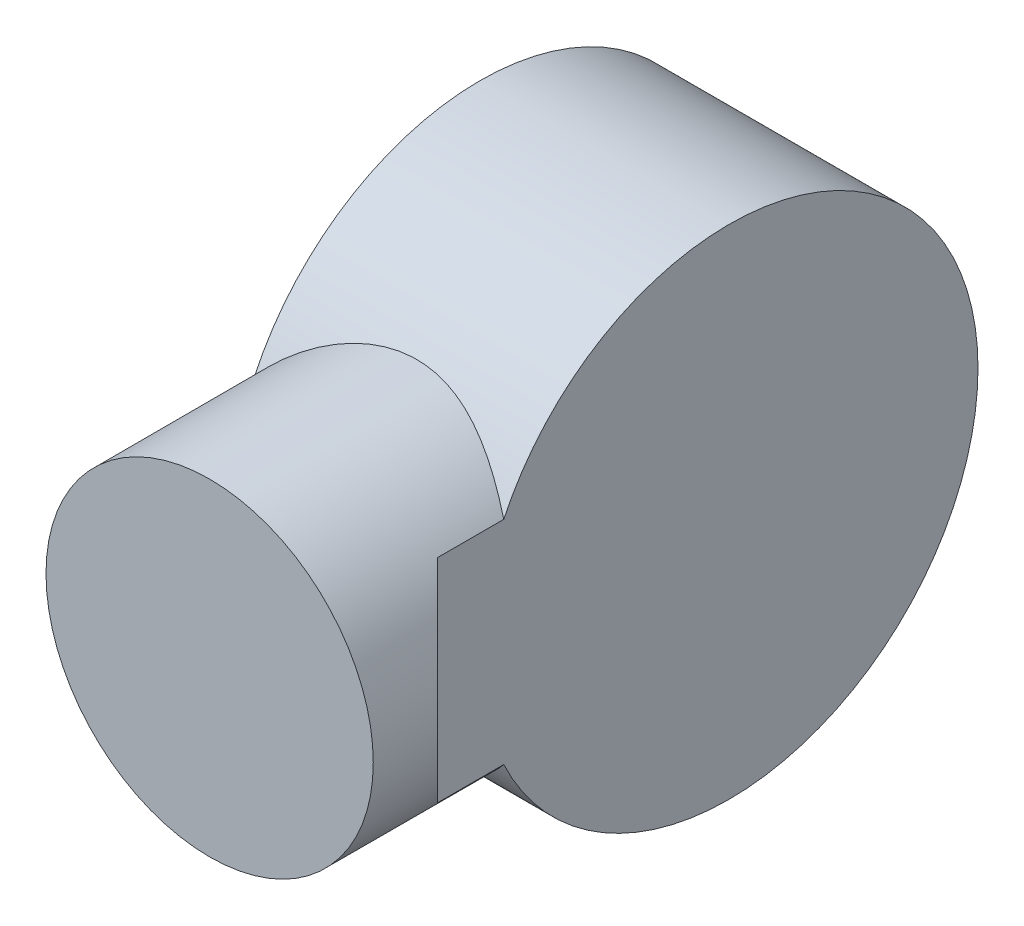
ISO-10303-21;
HEADER;
FILE_DESCRIPTION(('STEP AP214'),'2;1');
FILE_NAME('part.step','',(''),(''),'','','');
FILE_SCHEMA(('AUTOMOTIVE_DESIGN { 1 0 10303 214 1 1 1 1 }'));
ENDSEC;
DATA;
#1=APPLICATION_CONTEXT('core data for automotive mechanical design processes');
#2=APPLICATION_PROTOCOL_DEFINITION('international standard','automotive_design',2000,#1);
#3=PRODUCT_CONTEXT('',#1,'mechanical');
#4=PRODUCT('Part','Part','',(#3));
#5=PRODUCT_RELATED_PRODUCT_CATEGORY('part','',(#4));
#6=PRODUCT_DEFINITION_FORMATION('','',#4);
#7=PRODUCT_DEFINITION_CONTEXT('part definition',#1,'design');
#8=PRODUCT_DEFINITION('design','',#6,#7);
#9=PRODUCT_DEFINITION_SHAPE('','',#8);
#10=(LENGTH_UNIT() NAMED_UNIT(*) SI_UNIT(.MILLI.,.METRE.));
#11=(NAMED_UNIT(*) PLANE_ANGLE_UNIT() SI_UNIT($,.RADIAN.));
#12=(NAMED_UNIT(*) SI_UNIT($,.STERADIAN.) SOLID_ANGLE_UNIT());
#13=UNCERTAINTY_MEASURE_WITH_UNIT(LENGTH_MEASURE(1.E-05),#10,'distance_accuracy_value','');
#14=(GEOMETRIC_REPRESENTATION_CONTEXT(3) GLOBAL_UNCERTAINTY_ASSIGNED_CONTEXT((#13)) GLOBAL_UNIT_ASSIGNED_CONTEXT((#10,
#11,#12)) REPRESENTATION_CONTEXT('',''));
#15=CARTESIAN_POINT('',(0.,0.,0.));
#16=DIRECTION('',(0.,0.,1.));
#17=DIRECTION('',(1.,0.,0.));
#18=AXIS2_PLACEMENT_3D('',#15,#16,#17);
#19=CARTESIAN_POINT('',(49.,0.,905.998));
#20=DIRECTION('',(0.,0.,1.));
#21=DIRECTION('',(1.,0.,0.));
#22=AXIS2_PLACEMENT_3D('',#19,#20,#21);
#23=CYLINDRICAL_SURFACE('',#22,23.);
#24=CARTESIAN_POINT('',(49.,0.,964.5));
#25=DIRECTION('',(0.707106781186547,0.,0.707106781186548));
#26=DIRECTION('',(-0.707106781186548,0.,0.707106781186547));
#27=AXIS2_PLACEMENT_3D('',#24,#25,#26);
#28=ELLIPSE('',#27,32.5269119345812,23.);
#29=CARTESIAN_POINT('',(31.5,14.9248115565992,982.));
#30=VERTEX_POINT('',#29);
#31=CARTESIAN_POINT('',(31.5,-14.9248115565992,982.));
#32=VERTEX_POINT('',#31);
#33=EDGE_CURVE('E38',#30,#32,#28,.T.);
#34=ORIENTED_EDGE('',*,*,#33,.T.);
#35=DIRECTION('',(0.,0.,1.));
#36=VECTOR('',#35,1.);
#37=CARTESIAN_POINT('',(31.5,-14.9248115565992,905.998));
#38=LINE('',#37,#36);
#39=CARTESIAN_POINT('',(31.5,-14.9248115565992,972.658332236554));
#40=VERTEX_POINT('',#39);
#41=EDGE_CURVE('E138',#32,#40,#38,.F.);
#42=ORIENTED_EDGE('',*,*,#41,.T.);
#43=CARTESIAN_POINT('',(72.,0.,976.));
#44=CARTESIAN_POINT('',(71.9999974899214,-0.579392156234224,975.999997689453));
#45=CARTESIAN_POINT('',(71.9780758509982,-1.15882159599257,975.985580836534));
#46=CARTESIAN_POINT('',(71.8907214042049,-2.31298461608352,975.928270163406));
#47=CARTESIAN_POINT('',(71.8252850482549,-2.88771780962747,975.88537402107));
#48=CARTESIAN_POINT('',(71.6518385668175,-4.02829461207584,975.772136502232));
#49=CARTESIAN_POINT('',(71.5438042639617,-4.59413298255094,975.701779539991));
#50=CARTESIAN_POINT('',(71.2866930460353,-5.7124916316559,975.535302208606));
#51=CARTESIAN_POINT('',(71.1376164013162,-6.26501199798722,975.439182009168));
#52=CARTESIAN_POINT('',(70.8011512275983,-7.35059325130979,975.223874289497));
#53=CARTESIAN_POINT('',(70.6139495312577,-7.88373463586814,975.104799405735));
#54=CARTESIAN_POINT('',(70.2029182388201,-8.93042113717088,974.845801516114));
#55=CARTESIAN_POINT('',(69.9790886764442,-9.44396627195581,974.705878529449));
#56=CARTESIAN_POINT('',(69.4970012648832,-10.4490969206646,974.407950424157));
#57=CARTESIAN_POINT('',(69.2387452807688,-10.940683622274,974.249946285152));
#58=CARTESIAN_POINT('',(68.6899012134841,-11.9001392427702,973.918753345899));
#59=CARTESIAN_POINT('',(68.3993093818501,-12.3680054027343,973.745562785692));
#60=CARTESIAN_POINT('',(67.7621852793689,-13.3166677261423,973.372017325216));
#61=CARTESIAN_POINT('',(67.4130066215358,-13.7952686877747,973.170602081175));
#62=CARTESIAN_POINT('',(66.6812625426876,-14.7214585702166,972.757453313136));
#63=CARTESIAN_POINT('',(66.2986956184672,-15.169046093111,972.545719324758));
#64=CARTESIAN_POINT('',(65.5015595237633,-16.0326005449991,972.115730127228));
#65=CARTESIAN_POINT('',(65.0869490109654,-16.4485252026192,971.897466724027));
#66=CARTESIAN_POINT('',(64.2277403713228,-17.2470268613519,971.45894916796));
#67=CARTESIAN_POINT('',(63.7831404762812,-17.6296018930914,971.238694898374));
#68=CARTESIAN_POINT('',(62.795110707468,-18.4160856782575,970.767243230525));
#69=CARTESIAN_POINT('',(62.2469569160229,-18.8143300427071,970.516457095089));
#70=CARTESIAN_POINT('',(61.1140914503697,-19.562970875658,970.025688187753));
#71=CARTESIAN_POINT('',(60.5293718551497,-19.9133569242154,969.785707776128));
#72=CARTESIAN_POINT('',(59.3260001021839,-20.5630895288667,969.325213095387));
#73=CARTESIAN_POINT('',(58.7073957171631,-20.862505615856,969.104672508765));
#74=CARTESIAN_POINT('',(57.4379302394086,-21.4074263256684,968.6918583293));
#75=CARTESIAN_POINT('',(56.787084339533,-21.6529560501513,968.499571588939));
#76=CARTESIAN_POINT('',(55.644460055622,-22.0250635382025,968.201769486451));
#77=CARTESIAN_POINT('',(55.1596010977196,-22.1656585017504,968.08707794546));
#78=CARTESIAN_POINT('',(54.177067795029,-22.4155027489373,967.880690782996));
#79=CARTESIAN_POINT('',(53.6793955521229,-22.524757138408,967.788991416072));
#80=CARTESIAN_POINT('',(52.6745616083868,-22.710311120186,967.631871545078));
#81=CARTESIAN_POINT('',(52.1674143778585,-22.7866572633476,967.566413929578));
#82=CARTESIAN_POINT('',(51.146256738687,-22.9054087795153,967.464097107342));
#83=CARTESIAN_POINT('',(50.6322462778981,-22.9478138944942,967.42723811802));
#84=CARTESIAN_POINT('',(49.5993093995588,-22.9980255564483,967.383554693297));
#85=CARTESIAN_POINT('',(49.0803717740597,-23.005701716925,967.376843445343));
#86=CARTESIAN_POINT('',(48.0436796926312,-22.9859574634862,967.394050861961));
#87=CARTESIAN_POINT('',(47.5259252416544,-22.9585369029329,967.417969654509));
#88=CARTESIAN_POINT('',(46.495303235706,-22.8690680679741,967.495456076365));
#89=CARTESIAN_POINT('',(45.982439562892,-22.8069942922013,967.549045540136));
#90=CARTESIAN_POINT('',(44.9656109294026,-22.64924849296,967.683745030327));
#91=CARTESIAN_POINT('',(44.4616461455961,-22.5535758024871,967.764855603093));
#92=CARTESIAN_POINT('',(43.4851013694867,-22.3344237919654,967.947969029498));
#93=CARTESIAN_POINT('',(43.0120647949688,-22.2121784015352,968.049030664259));
#94=CARTESIAN_POINT('',(42.0788040171469,-21.9393145747276,968.270815322055));
#95=CARTESIAN_POINT('',(41.6185848752677,-21.7886851072212,968.391545986741));
#96=CARTESIAN_POINT('',(40.7125918684213,-21.4604533555387,968.649457112973));
#97=CARTESIAN_POINT('',(40.2668195658206,-21.2828481657812,968.786639346199));
#98=CARTESIAN_POINT('',(39.3909496280651,-20.9020136812522,969.074236326805));
#99=CARTESIAN_POINT('',(38.9608484656436,-20.6987901991592,969.224648070136));
#100=CARTESIAN_POINT('',(38.0324199363083,-20.2246289720006,969.56687048218));
#101=CARTESIAN_POINT('',(37.5376823560592,-19.9482813778786,969.760938859552));
#102=CARTESIAN_POINT('',(36.5727630569015,-19.3618850125799,970.158926630307));
#103=CARTESIAN_POINT('',(36.1025836738593,-19.051833044204,970.362846957224));
#104=CARTESIAN_POINT('',(35.1872283775591,-18.399012875191,970.776261423493));
#105=CARTESIAN_POINT('',(34.7420803906652,-18.0562092419666,970.985761418475));
#106=CARTESIAN_POINT('',(33.8783482109791,-17.3392817767104,971.405953373856));
#107=CARTESIAN_POINT('',(33.4597657333146,-16.9651559260564,971.616645410261));
#108=CARTESIAN_POINT('',(32.5679596880372,-16.1072904241768,972.077935750963));
#109=CARTESIAN_POINT('',(32.1009473031602,-15.6167363581993,972.327931253959));
#110=CARTESIAN_POINT('',(31.2096354467312,-14.5932674625639,972.817580614873));
#111=CARTESIAN_POINT('',(30.7853435868367,-14.0603451141731,973.057232625526));
#112=CARTESIAN_POINT('',(29.9830295073886,-12.9545759165637,973.519806962411));
#113=CARTESIAN_POINT('',(29.604971147608,-12.3817608080031,973.74274230246));
#114=CARTESIAN_POINT('',(28.8985362420415,-11.1984654765942,974.166080540298));
#115=CARTESIAN_POINT('',(28.5701459238542,-10.587995761297,974.366489680381));
#116=CARTESIAN_POINT('',(28.0266916887949,-9.45687916420717,974.702278176503));
#117=CARTESIAN_POINT('',(27.8020550513491,-8.94230411938505,974.842683732743));
#118=CARTESIAN_POINT('',(27.3895792682631,-7.89348596608105,975.102560193756));
#119=CARTESIAN_POINT('',(27.2017357156522,-7.3592452222177,975.222033605539));
#120=CARTESIAN_POINT('',(26.865075641683,-6.27435063114442,975.437452733822));
#121=CARTESIAN_POINT('',(26.7162331869801,-5.72370796291809,975.533414081635));
#122=CARTESIAN_POINT('',(26.4593098932004,-4.60915523381695,975.699756712118));
#123=CARTESIAN_POINT('',(26.3512297307184,-4.04524495288406,975.770137570187));
#124=CARTESIAN_POINT('',(26.1770072444865,-2.90592563241028,975.883873315345));
#125=CARTESIAN_POINT('',(26.111034779534,-2.33047955871047,975.927118728708));
#126=CARTESIAN_POINT('',(26.0227142246396,-1.17480496439297,975.985061758044));
#127=CARTESIAN_POINT('',(26.0003661734378,-0.594576439528738,975.999759348667));
#128=CARTESIAN_POINT('',(25.9996427542765,0.565917241563993,976.00023478455));
#129=CARTESIAN_POINT('',(26.0212673756236,1.14618239778355,975.986012636844));
#130=CARTESIAN_POINT('',(26.1081531826018,2.30199707509385,975.929007625789));
#131=CARTESIAN_POINT('',(26.173412790505,2.87754676592195,975.886225795084));
#132=CARTESIAN_POINT('',(26.3410191237689,3.98280699526344,975.776797985169));
#133=CARTESIAN_POINT('',(26.4407216183424,4.51309173210333,975.711856710133));
#134=CARTESIAN_POINT('',(26.6762256681694,5.562203753342,975.559265851017));
#135=CARTESIAN_POINT('',(26.812025362156,6.08103162699334,975.471617437784));
#136=CARTESIAN_POINT('',(27.1181846121201,7.1043241560831,975.275356262261));
#137=CARTESIAN_POINT('',(27.2885463598536,7.60878789830401,975.166742170451));
#138=CARTESIAN_POINT('',(27.6620871613965,8.60084028322363,974.930599585468));
#139=CARTESIAN_POINT('',(27.8652679865421,9.08842801335168,974.803070071407));
#140=CARTESIAN_POINT('',(28.3170307921044,10.0761503268992,974.52240806563));
#141=CARTESIAN_POINT('',(28.5677210373294,10.5749978401782,974.368142786165));
#142=CARTESIAN_POINT('',(29.1021398440097,11.5491943184905,974.043604076348));
#143=CARTESIAN_POINT('',(29.3858695188294,12.0245424908724,973.873330106571));
#144=CARTESIAN_POINT('',(29.9844762379121,12.9504412557452,973.519713766135));
#145=CARTESIAN_POINT('',(30.2993691452624,13.4009790354494,973.336364753264));
#146=CARTESIAN_POINT('',(30.9583580487764,14.2758233279965,972.959782961409));
#147=CARTESIAN_POINT('',(31.3024571876837,14.7001270094004,972.766549119657));
#148=CARTESIAN_POINT('',(32.0743581525259,15.5858825739965,972.342584099299));
#149=CARTESIAN_POINT('',(32.5068264306248,16.0427350942053,972.110722346361));
#150=CARTESIAN_POINT('',(33.4066348315705,16.9186670581601,971.643192251573));
#151=CARTESIAN_POINT('',(33.8739797394562,17.337741301285,971.407523390879));
#152=CARTESIAN_POINT('',(34.8420967295209,18.1369232179953,970.937718155491));
#153=CARTESIAN_POINT('',(35.3428868443376,18.5170095858443,970.703582683481));
#154=CARTESIAN_POINT('',(36.3762345777062,19.236340214995,970.242872501176));
#155=CARTESIAN_POINT('',(36.9087882723073,19.5755895055887,970.016296862338));
#156=CARTESIAN_POINT('',(37.9465845050306,20.1777838475537,969.600288891279));
#157=CARTESIAN_POINT('',(38.4487872385022,20.4450027135739,969.40945899171));
#158=CARTESIAN_POINT('',(39.4764974881292,20.9434716083319,969.044010284494));
#159=CARTESIAN_POINT('',(40.002004853267,21.1747218701083,968.86939137182));
#160=CARTESIAN_POINT('',(41.0739663626761,21.5988359726303,968.542004112203));
#161=CARTESIAN_POINT('',(41.6203880725073,21.791756591284,968.38920354153));
#162=CARTESIAN_POINT('',(42.7325788272169,22.1372598744361,968.11071859001));
#163=CARTESIAN_POINT('',(43.2983439417736,22.289850679049,967.985028738116));
#164=CARTESIAN_POINT('',(44.3523463786754,22.5309141624498,967.783919730644));
#165=CARTESIAN_POINT('',(44.8381988534973,22.6257825729005,967.703646770645));
#166=CARTESIAN_POINT('',(45.8184682878519,22.7842984945214,967.568527368038));
#167=CARTESIAN_POINT('',(46.3128842667014,22.8479495565124,967.513678033656));
#168=CARTESIAN_POINT('',(47.3067148618982,22.9430112149655,967.431462551491));
#169=CARTESIAN_POINT('',(47.8061253574108,22.974446480199,967.404075375311));
#170=CARTESIAN_POINT('',(48.8067029109627,23.0046330515463,967.377779892781));
#171=CARTESIAN_POINT('',(49.3078700016482,23.0033837469645,967.378872118553));
#172=CARTESIAN_POINT('',(50.3080540616764,22.9682247677444,967.409490335469));
#173=CARTESIAN_POINT('',(50.807071510735,22.9343228044424,967.439009613206));
#174=CARTESIAN_POINT('',(51.7994649868086,22.8344418882685,967.525319690487));
#175=CARTESIAN_POINT('',(52.2928410627046,22.7684632135487,967.582110253548));
#176=CARTESIAN_POINT('',(53.271343101023,22.6053521241233,967.720956089935));
#177=CARTESIAN_POINT('',(53.7564592532007,22.5081850616868,967.803039457407));
#178=CARTESIAN_POINT('',(54.7153251290766,22.284021089363,967.989694885765));
#179=CARTESIAN_POINT('',(55.1890733692412,22.1570203092043,968.094269864295));
#180=CARTESIAN_POINT('',(56.2552060904752,21.8346870659053,968.355085605207));
#181=CARTESIAN_POINT('',(56.8433028305935,21.6301862300423,968.517576492887));
#182=CARTESIAN_POINT('',(57.9946434224348,21.177331405589,968.867587891031));
#183=CARTESIAN_POINT('',(58.5578802149262,20.9289650598137,969.055115450837));
#184=CARTESIAN_POINT('',(59.6581026915165,20.390691709844,969.44874251037));
#185=CARTESIAN_POINT('',(60.1950596747085,20.1007405902359,969.654861645778));
#186=CARTESIAN_POINT('',(61.2406903216136,19.4816497128915,970.07930828783));
#187=CARTESIAN_POINT('',(61.7493656017113,19.1525121981603,970.297635095335));
#188=CARTESIAN_POINT('',(62.7455742426315,18.4509220112439,970.744568310056));
#189=CARTESIAN_POINT('',(63.2326126634143,18.0778377643957,970.973285497856));
#190=CARTESIAN_POINT('',(64.1749988024742,17.29436018643,971.432075291834));
#191=CARTESIAN_POINT('',(64.630346460067,16.8839667838729,971.662147900606));
#192=CARTESIAN_POINT('',(65.5079147540046,16.0270065554484,972.118656835707));
#193=CARTESIAN_POINT('',(65.9301261648815,15.5804297255843,972.345092135514));
#194=CARTESIAN_POINT('',(66.7393591567397,14.6524462133339,972.789472189205));
#195=CARTESIAN_POINT('',(67.1263784379402,14.1710372583791,973.007416387672));
#196=CARTESIAN_POINT('',(67.906686650833,13.1155433650445,973.455337318938));
#197=CARTESIAN_POINT('',(68.2952528816458,12.5372442160739,973.683665086813));
#198=CARTESIAN_POINT('',(69.0215643475554,11.3413630087306,974.117642780472));
#199=CARTESIAN_POINT('',(69.3593019947951,10.7237751047436,974.323289319107));
#200=CARTESIAN_POINT('',(69.9791444926649,9.45375806257623,974.70556385618));
#201=CARTESIAN_POINT('',(70.2613384739288,8.80138691494625,974.882238268738));
#202=CARTESIAN_POINT('',(70.6398783699576,7.80019819484696,975.121472288598));
#203=CARTESIAN_POINT('',(70.7585906121699,7.46272996462744,975.196914714869));
#204=CARTESIAN_POINT('',(70.9806631384688,6.78078369339897,975.338640427375));
#205=CARTESIAN_POINT('',(71.0840201783227,6.43630418848515,975.404921777861));
#206=CARTESIAN_POINT('',(71.3141335141187,5.59806033497158,975.553001066241));
#207=CARTESIAN_POINT('',(71.432998023722,5.10123791350861,975.629948545821));
#208=CARTESIAN_POINT('',(71.6377308648578,4.09818584300977,975.76292286434));
#209=CARTESIAN_POINT('',(71.7236051459924,3.59195790748564,975.818953475466));
#210=CARTESIAN_POINT('',(71.8613882716938,2.5731353752274,975.909029608067));
#211=CARTESIAN_POINT('',(71.9133100551086,2.06054327976371,975.943083504512));
#212=CARTESIAN_POINT('',(71.9826191188807,1.03197758024032,975.988571093002));
#213=CARTESIAN_POINT('',(72.0000022354627,0.516003575999582,976.000002057761));
#214=CARTESIAN_POINT('',(72.,0.,976.));
#215=B_SPLINE_CURVE_WITH_KNOTS('',3,(#43,#44,#45,#46,#47,#48,#49,#50,#51,#52,#53,#54,#55,#56,
#57,#58,#59,#60,#61,#62,#63,#64,#65,#66,#67,#68,#69,#70,#71,#72,#73,#74,#75,#76,#77,#78,#79,#80,
#81,#82,#83,#84,#85,#86,#87,#88,#89,#90,#91,#92,#93,#94,#95,#96,#97,#98,#99,#100,#101,#102,#103,
#104,#105,#106,#107,#108,#109,#110,#111,#112,#113,#114,#115,#116,#117,#118,#119,#120,#121,#122,
#123,#124,#125,#126,#127,#128,#129,#130,#131,#132,#133,#134,#135,#136,#137,#138,#139,#140,#141,
#142,#143,#144,#145,#146,#147,#148,#149,#150,#151,#152,#153,#154,#155,#156,#157,#158,#159,#160,
#161,#162,#163,#164,#165,#166,#167,#168,#169,#170,#171,#172,#173,#174,#175,#176,#177,#178,#179,
#180,#181,#182,#183,#184,#185,#186,#187,#188,#189,#190,#191,#192,#193,#194,#195,#196,#197,#198,
#199,#200,#201,#202,#203,#204,#205,#206,#207,#208,#209,#210,#211,#212,#213,#214),.UNSPECIFIED.,
.T.,.F.,(4,2,2,2,2,2,2,2,2,2,2,2,2,2,2,2,2,2,2,2,2,2,2,2,2,2,2,2,2,2,2,2,2,2,2,2,2,2,2,2,2,2,2,
2,2,2,2,2,2,2,2,2,2,2,2,2,2,2,2,2,2,2,2,2,2,2,2,2,2,2,2,2,2,2,2,2,2,2,2,2,2,2,2,2,2,4),(0.,
1.73765259041073,3.47544688199151,5.21422891863012,6.95299950194629,8.68344582382025,
10.4138905525862,12.1442415716095,13.8747933872364,15.7501849218953,17.6256609339659,
19.5035984113504,21.38164671031,23.5465012075547,25.711826298594,27.8741734604515,
30.0355111970551,31.58715852026,33.1385529139829,34.6877454994652,36.2369498621316,
37.7919657619876,39.3469881588759,40.9031564110725,42.4593555580082,43.9546885749595,
45.4506039381166,46.94668054219,48.4424183019508,50.2377494329386,52.0332510180205,
53.8307175605517,55.6283000336623,57.7916315414398,59.9553478175995,62.1173617798295,
64.2787751359139,66.0133134644679,67.7476439077505,69.4808181839693,71.2140212271005,
72.9541723949168,74.6943251080529,76.4344773980135,78.1745667719902,79.8031620816033,
81.4316734328333,83.0602880885679,84.6889906745147,86.4249115311361,88.1608909018443,
89.8977585320923,91.6348132959225,93.6440963687709,95.6536556218634,97.6643072546717,
99.6747110116963,101.473166716991,103.271610769711,105.06737058278,106.862767664875,
108.365681957306,109.868425260914,111.370016999264,112.871636794164,114.372902049581,
115.87415428706,117.377080098188,118.880200988797,120.807897128969,122.736137181734,
124.666438159806,126.596628701711,128.55905370604,130.521482468102,132.484455666276,
134.447557051308,136.643997690551,138.840765897075,141.033979694764,142.130376985219,
143.227005593027,144.775232820986,146.323180703661,147.870538339553,149.418082504328),.UNSPECIFIED.);
#216=CARTESIAN_POINT('',(66.5,-14.9248115565994,972.658332236554));
#217=VERTEX_POINT('',#216);
#218=EDGE_CURVE('E87',#217,#40,#215,.T.);
#219=ORIENTED_EDGE('',*,*,#218,.F.);
#220=DIRECTION('',(0.,0.,1.));
#221=VECTOR('',#220,1.);
#222=CARTESIAN_POINT('',(66.5,-14.9248115565994,905.998));
#223=LINE('',#222,#221);
#224=CARTESIAN_POINT('',(66.5,-14.9248115565994,982.));
#225=VERTEX_POINT('',#224);
#226=EDGE_CURVE('E134',#217,#225,#223,.T.);
#227=ORIENTED_EDGE('',*,*,#226,.T.);
#228=CARTESIAN_POINT('',(49.,0.,964.5));
#229=DIRECTION('',(-0.70710678118654,0.,0.707106781186555));
#230=DIRECTION('',(0.707106781186555,0.,0.707106781186541));
#231=AXIS2_PLACEMENT_3D('',#228,#229,#230);
#232=ELLIPSE('',#231,32.5269119345809,23.);
#233=CARTESIAN_POINT('',(66.5,14.9248115565994,982.));
#234=VERTEX_POINT('',#233);
#235=EDGE_CURVE('E96',#225,#234,#232,.T.);
#236=ORIENTED_EDGE('',*,*,#235,.T.);
#237=DIRECTION('',(0.,0.,1.));
#238=VECTOR('',#237,1.);
#239=CARTESIAN_POINT('',(66.5,14.9248115565994,905.998));
#240=LINE('',#239,#238);
#241=CARTESIAN_POINT('',(66.5,14.9248115565994,972.658332236554));
#242=VERTEX_POINT('',#241);
#243=EDGE_CURVE('E69',#234,#242,#240,.F.);
#244=ORIENTED_EDGE('',*,*,#243,.T.);
#245=CARTESIAN_POINT('',(66.5,14.9248115565994,972.658332236554));
#246=CARTESIAN_POINT('',(66.2838261309879,15.1782760575656,972.538841774483));
#247=CARTESIAN_POINT('',(66.0624952098064,15.4266516289361,972.418026674487));
#248=CARTESIAN_POINT('',(65.6097766594462,15.913069288131,972.174480008364));
#249=CARTESIAN_POINT('',(65.3783893347739,16.1511116884064,972.051748500336));
#250=CARTESIAN_POINT('',(64.6694188977148,16.8496167634872,971.681720629803));
#251=CARTESIAN_POINT('',(64.1771096878218,17.2943608479953,971.43263689782));
#252=CARTESIAN_POINT('',(63.1514957984183,18.1433722842368,970.934300135016));
#253=CARTESIAN_POINT('',(62.6179002583757,18.5472953666252,970.685061055122));
#254=CARTESIAN_POINT('',(61.5148092352264,19.3087674850948,970.19548331773));
#255=CARTESIAN_POINT('',(60.9453217832457,19.6663268411002,969.955142688098));
#256=CARTESIAN_POINT('',(59.8671034431382,20.2787003381811,969.528760189563));
#257=CARTESIAN_POINT('',(59.3634720145768,20.5407757978809,969.340228734237));
#258=CARTESIAN_POINT('',(58.3332127185652,21.0289320496666,968.979922095382));
#259=CARTESIAN_POINT('',(57.8065858568283,21.2550144139182,968.808146180102));
#260=CARTESIAN_POINT('',(56.7336704840584,21.6684048780705,968.487243108977));
#261=CARTESIAN_POINT('',(56.1874505375919,21.8558351530725,968.338044997929));
#262=CARTESIAN_POINT('',(55.0761623938349,22.1904651692718,968.067133320897));
#263=CARTESIAN_POINT('',(54.5110978095046,22.3376725729497,967.945414520858));
#264=CARTESIAN_POINT('',(53.4577378586353,22.5692443685742,967.751601363432));
#265=CARTESIAN_POINT('',(52.9717124335276,22.6599081830089,967.674674259647));
#266=CARTESIAN_POINT('',(51.9915201764047,22.8100092530613,967.546436292207));
#267=CARTESIAN_POINT('',(51.4973542928315,22.8694501202842,967.495122465859));
#268=CARTESIAN_POINT('',(50.5043314122443,22.9561596583,967.42003120865));
#269=CARTESIAN_POINT('',(50.0054766215801,22.9834427650255,967.396241422067));
#270=CARTESIAN_POINT('',(49.00648472964,23.0054247381349,967.37708579828));
#271=CARTESIAN_POINT('',(48.5063476012042,23.000122908576,967.381720568162));
#272=CARTESIAN_POINT('',(47.5088987839972,22.9570392447352,967.419219260966));
#273=CARTESIAN_POINT('',(47.011585385511,22.9192797979683,967.452063726347));
#274=CARTESIAN_POINT('',(46.0229794395884,22.8119398831631,967.544686613217));
#275=CARTESIAN_POINT('',(45.5316868471241,22.7423596532523,967.60446483315));
#276=CARTESIAN_POINT('',(44.5576662217536,22.572336257308,967.748869968448));
#277=CARTESIAN_POINT('',(44.074947963856,22.4718599928867,967.833523527997));
#278=CARTESIAN_POINT('',(43.1210826831111,22.2413846471953,968.024862576214));
#279=CARTESIAN_POINT('',(42.649937098628,22.1113819164592,968.131550788214));
#280=CARTESIAN_POINT('',(41.584859391504,21.7809805144634,968.397922530636));
#281=CARTESIAN_POINT('',(40.9954405529861,21.5711180443598,968.563971975394));
#282=CARTESIAN_POINT('',(39.8419467922444,21.1072690740481,968.920758112439));
#283=CARTESIAN_POINT('',(39.2778800926178,20.8532683863913,969.111502737514));
#284=CARTESIAN_POINT('',(38.1762042484044,20.3033270841612,969.511236948177));
#285=CARTESIAN_POINT('',(37.6386380574274,20.0073212137273,969.720254723741));
#286=CARTESIAN_POINT('',(36.5923299362008,19.3758365760353,970.150004326555));
#287=CARTESIAN_POINT('',(36.0835825019974,19.0403653839785,970.370733901324));
#288=CARTESIAN_POINT('',(35.2114114150741,18.4144447771878,970.765944511961));
#289=CARTESIAN_POINT('',(34.8417990561979,18.1317810946686,970.939186002408));
#290=CARTESIAN_POINT('',(34.120751983671,17.544913790116,971.286833641187));
#291=CARTESIAN_POINT('',(33.7693144204247,17.2407135625877,971.461239602073));
#292=CARTESIAN_POINT('',(33.0869819003516,16.6129380339436,971.808086145722));
#293=CARTESIAN_POINT('',(32.7559902936006,16.2894708174522,971.980532226244));
#294=CARTESIAN_POINT('',(32.1133080653185,15.6222293679245,972.32230391635));
#295=CARTESIAN_POINT('',(31.8016207138026,15.2784517135984,972.491628993862));
#296=CARTESIAN_POINT('',(31.5,14.9248115565992,972.658332236554));
#297=B_SPLINE_CURVE_WITH_KNOTS('',3,(#245,#246,#247,#248,#249,#250,#251,#252,#253,#254,#255,
#256,#257,#258,#259,#260,#261,#262,#263,#264,#265,#266,#267,#268,#269,#270,#271,#272,#273,#274,
#275,#276,#277,#278,#279,#280,#281,#282,#283,#284,#285,#286,#287,#288,#289,#290,#291,#292,#293,
#294,#295,#296),.UNSPECIFIED.,.F.,.F.,(4,2,2,2,2,2,2,2,2,2,2,2,2,2,2,2,2,2,2,2,2,2,2,2,2,4),(0.,
1.06156763996573,2.12310315820902,4.2465777356734,6.38668224134141,8.52630956863797,
10.3193796172003,12.1123713236016,13.8996056392175,15.6864992479026,17.1859963597299,
18.6853199842522,20.1839702911047,21.6826526059437,23.1803020391905,24.6779402651178,
26.1771885077336,27.6766221581074,29.6158038534383,31.555610021276,33.4984633944922,
35.4409444518419,36.9297227070245,38.418266827051,39.8991294160607,41.3802421713225),.UNSPECIFIED.);
#298=CARTESIAN_POINT('',(31.5,14.9248115565993,972.658332236554));
#299=VERTEX_POINT('',#298);
#300=EDGE_CURVE('E83',#242,#299,#297,.T.);
#301=ORIENTED_EDGE('',*,*,#300,.T.);
#302=DIRECTION('',(0.,0.,1.));
#303=VECTOR('',#302,1.);
#304=CARTESIAN_POINT('',(31.5,14.9248115565992,905.998));
#305=LINE('',#304,#303);
#306=EDGE_CURVE('E76',#299,#30,#305,.T.);
#307=ORIENTED_EDGE('',*,*,#306,.T.);
#308=EDGE_LOOP('',(#34,#42,#219,#227,#236,#244,#301,#307));
#309=FACE_BOUND('',#308,.T.);
#310=CARTESIAN_POINT('',(49.,0.,996.5));
#311=DIRECTION('',(0.,0.,1.));
#312=DIRECTION('',(1.,0.,0.));
#313=AXIS2_PLACEMENT_3D('',#310,#311,#312);
#314=CIRCLE('',#313,23.);
#315=CARTESIAN_POINT('',(72.,0.,996.5));
#316=VERTEX_POINT('',#315);
#317=EDGE_CURVE('E10',#316,#316,#314,.T.);
#318=ORIENTED_EDGE('',*,*,#317,.F.);
#319=EDGE_LOOP('',(#318));
#320=FACE_BOUND('',#319,.T.);
#321=ADVANCED_FACE('F16',(#309,#320),#23,.T.);
#322=CARTESIAN_POINT('',(66.502,0.,941.));
#323=DIRECTION('',(-1.,0.,0.));
#324=DIRECTION('',(0.,0.,1.));
#325=AXIS2_PLACEMENT_3D('',#322,#323,#324);
#326=CYLINDRICAL_SURFACE('',#325,35.);
#327=ORIENTED_EDGE('',*,*,#300,.F.);
#328=CARTESIAN_POINT('',(66.5,0.,941.));
#329=DIRECTION('',(-1.,0.,0.));
#330=DIRECTION('',(0.,0.,1.));
#331=AXIS2_PLACEMENT_3D('',#328,#329,#330);
#332=CIRCLE('',#331,35.);
#333=EDGE_CURVE('E58',#242,#217,#332,.T.);
#334=ORIENTED_EDGE('',*,*,#333,.T.);
#335=ORIENTED_EDGE('',*,*,#218,.T.);
#336=CARTESIAN_POINT('',(31.5,0.,941.));
#337=DIRECTION('',(-1.,0.,0.));
#338=DIRECTION('',(0.,0.,1.));
#339=AXIS2_PLACEMENT_3D('',#336,#337,#338);
#340=CIRCLE('',#339,35.);
#341=EDGE_CURVE('E80',#299,#40,#340,.T.);
#342=ORIENTED_EDGE('',*,*,#341,.F.);
#343=EDGE_LOOP('',(#327,#334,#335,#342));
#344=FACE_BOUND('',#343,.T.);
#345=ADVANCED_FACE('F85',(#344),#326,.T.);
#346=CARTESIAN_POINT('',(66.5,1056.01589394116,941.));
#347=DIRECTION('',(-1.,0.,0.));
#348=DIRECTION('',(0.,0.,1.));
#349=AXIS2_PLACEMENT_3D('',#346,#347,#348);
#350=PLANE('',#349);
#351=ORIENTED_EDGE('',*,*,#333,.F.);
#352=ORIENTED_EDGE('',*,*,#243,.F.);
#353=DIRECTION('',(0.,-1.,0.));
#354=VECTOR('',#353,1.);
#355=CARTESIAN_POINT('',(66.5,1083.80354493302,982.));
#356=LINE('',#355,#354);
#357=EDGE_CURVE('E89',#234,#225,#356,.T.);
#358=ORIENTED_EDGE('',*,*,#357,.T.);
#359=ORIENTED_EDGE('',*,*,#226,.F.);
#360=EDGE_LOOP('',(#351,#352,#358,#359));
#361=FACE_BOUND('',#360,.T.);
#362=ADVANCED_FACE('F129',(#361),#350,.F.);
#363=CARTESIAN_POINT('',(31.5,1056.01589394116,941.));
#364=DIRECTION('',(-1.,0.,0.));
#365=DIRECTION('',(0.,0.,1.));
#366=AXIS2_PLACEMENT_3D('',#363,#364,#365);
#367=PLANE('',#366);
#368=ORIENTED_EDGE('',*,*,#341,.T.);
#369=ORIENTED_EDGE('',*,*,#41,.F.);
#370=DIRECTION('',(0.,-1.,0.));
#371=VECTOR('',#370,1.);
#372=CARTESIAN_POINT('',(31.5,1083.80354493302,982.));
#373=LINE('',#372,#371);
#374=EDGE_CURVE('E26',#30,#32,#373,.T.);
#375=ORIENTED_EDGE('',*,*,#374,.F.);
#376=ORIENTED_EDGE('',*,*,#306,.F.);
#377=EDGE_LOOP('',(#368,#369,#375,#376));
#378=FACE_BOUND('',#377,.T.);
#379=ADVANCED_FACE('F78',(#378),#367,.T.);
#380=CARTESIAN_POINT('',(69.25,1083.80354493302,984.75));
#381=DIRECTION('',(-0.70710678118654,0.,0.707106781186555));
#382=DIRECTION('',(0.707106781186555,0.,0.707106781186541));
#383=AXIS2_PLACEMENT_3D('',#380,#381,#382);
#384=PLANE('',#383);
#385=ORIENTED_EDGE('',*,*,#235,.F.);
#386=ORIENTED_EDGE('',*,*,#357,.F.);
#387=EDGE_LOOP('',(#385,#386));
#388=FACE_BOUND('',#387,.T.);
#389=ADVANCED_FACE('F121',(#388),#384,.F.);
#390=CARTESIAN_POINT('',(28.75,1083.80354493302,984.75));
#391=DIRECTION('',(0.707106781186547,0.,0.707106781186548));
#392=DIRECTION('',(0.707106781186548,0.,-0.707106781186547));
#393=AXIS2_PLACEMENT_3D('',#390,#391,#392);
#394=PLANE('',#393);
#395=ORIENTED_EDGE('',*,*,#33,.F.);
#396=ORIENTED_EDGE('',*,*,#374,.T.);
#397=EDGE_LOOP('',(#395,#396));
#398=FACE_BOUND('',#397,.T.);
#399=ADVANCED_FACE('F111',(#398),#394,.F.);
#400=CARTESIAN_POINT('',(49.,0.,996.5));
#401=DIRECTION('',(0.,0.,1.));
#402=DIRECTION('',(1.,0.,0.));
#403=AXIS2_PLACEMENT_3D('',#400,#401,#402);
#404=PLANE('',#403);
#405=ORIENTED_EDGE('',*,*,#317,.T.);
#406=EDGE_LOOP('',(#405));
#407=FACE_BOUND('',#406,.T.);
#408=ADVANCED_FACE('F18',(#407),#404,.T.);
#409=CLOSED_SHELL('',(#321,#345,#362,#379,#389,#399,#408));
#410=MANIFOLD_SOLID_BREP('B1',#409);
#411=ADVANCED_BREP_SHAPE_REPRESENTATION('',(#18,#410),#14);
#412=SHAPE_DEFINITION_REPRESENTATION(#9,#411);
ENDSEC;
END-ISO-10303-21;
